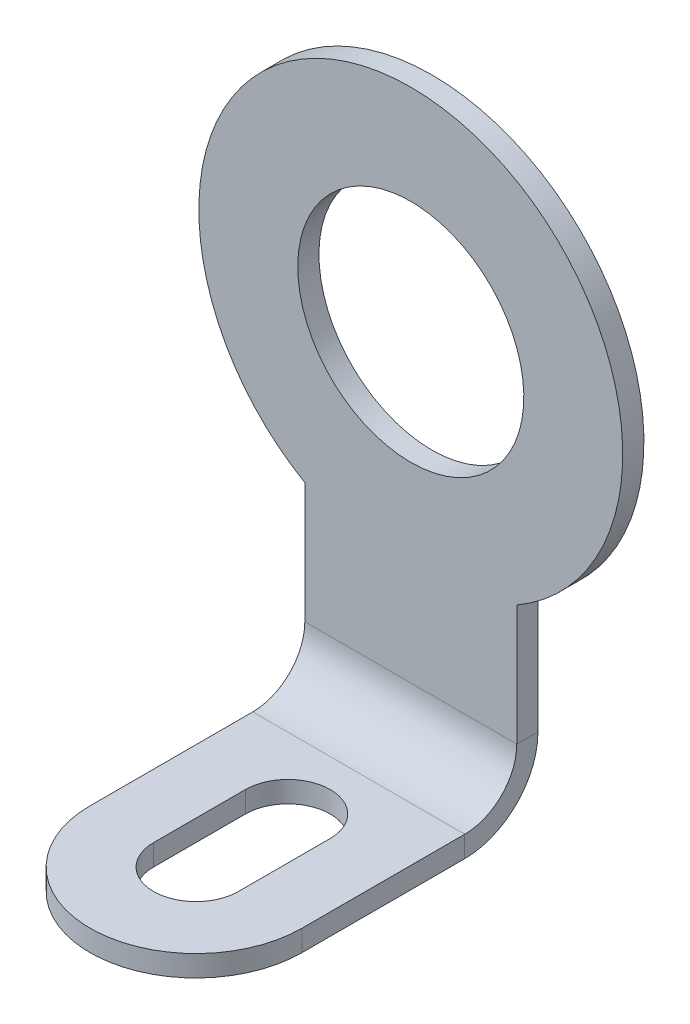
ISO-10303-21;
HEADER;
FILE_DESCRIPTION(('STEP AP214'),'2;1');
FILE_NAME('part.step','',(''),(''),'','','');
FILE_SCHEMA(('AUTOMOTIVE_DESIGN { 1 0 10303 214 1 1 1 1 }'));
ENDSEC;
DATA;
#1=APPLICATION_CONTEXT('core data for automotive mechanical design processes');
#2=APPLICATION_PROTOCOL_DEFINITION('international standard','automotive_design',2000,#1);
#3=PRODUCT_CONTEXT('',#1,'mechanical');
#4=PRODUCT('Part','Part','',(#3));
#5=PRODUCT_RELATED_PRODUCT_CATEGORY('part','',(#4));
#6=PRODUCT_DEFINITION_FORMATION('','',#4);
#7=PRODUCT_DEFINITION_CONTEXT('part definition',#1,'design');
#8=PRODUCT_DEFINITION('design','',#6,#7);
#9=PRODUCT_DEFINITION_SHAPE('','',#8);
#10=(LENGTH_UNIT() NAMED_UNIT(*) SI_UNIT(.MILLI.,.METRE.));
#11=(NAMED_UNIT(*) PLANE_ANGLE_UNIT() SI_UNIT($,.RADIAN.));
#12=(NAMED_UNIT(*) SI_UNIT($,.STERADIAN.) SOLID_ANGLE_UNIT());
#13=UNCERTAINTY_MEASURE_WITH_UNIT(LENGTH_MEASURE(1.E-05),#10,'distance_accuracy_value','');
#14=(GEOMETRIC_REPRESENTATION_CONTEXT(3) GLOBAL_UNCERTAINTY_ASSIGNED_CONTEXT((#13)) GLOBAL_UNIT_ASSIGNED_CONTEXT((#10,
#11,#12)) REPRESENTATION_CONTEXT('',''));
#15=CARTESIAN_POINT('',(0.,0.,0.));
#16=DIRECTION('',(0.,0.,1.));
#17=DIRECTION('',(1.,0.,0.));
#18=AXIS2_PLACEMENT_3D('',#15,#16,#17);
#19=CARTESIAN_POINT('',(0.,-2.95973401166818,4.65973401166817));
#20=DIRECTION('',(0.,0.,1.));
#21=DIRECTION('',(0.,-1.,0.));
#22=AXIS2_PLACEMENT_3D('',#19,#20,#21);
#23=PLANE('',#22);
#24=CARTESIAN_POINT('',(0.,5.04026598833182,4.65973401166819));
#25=DIRECTION('',(0.,0.,1.));
#26=DIRECTION('',(0.,-1.,0.));
#27=AXIS2_PLACEMENT_3D('',#24,#25,#26);
#28=CIRCLE('',#27,1.6);
#29=CARTESIAN_POINT('',(0.,3.44026598833182,4.65973401166819));
#30=VERTEX_POINT('',#29);
#31=EDGE_CURVE('E210',#30,#30,#28,.T.);
#32=ORIENTED_EDGE('',*,*,#31,.T.);
#33=EDGE_LOOP('',(#32));
#34=FACE_BOUND('',#33,.T.);
#35=DIRECTION('',(0.,1.,0.));
#36=VECTOR('',#35,1.);
#37=CARTESIAN_POINT('',(1.5,-2.95973401166818,4.65973401166817));
#38=LINE('',#37,#36);
#39=CARTESIAN_POINT('',(1.5,0.736600000000003,4.65973401166818));
#40=VERTEX_POINT('',#39);
#41=CARTESIAN_POINT('',(1.5,2.44218977697851,4.65973401166818));
#42=VERTEX_POINT('',#41);
#43=EDGE_CURVE('E45',#40,#42,#38,.T.);
#44=ORIENTED_EDGE('',*,*,#43,.F.);
#45=DIRECTION('',(-1.,0.,0.));
#46=VECTOR('',#45,1.);
#47=CARTESIAN_POINT('',(0.,0.736600000000003,4.65973401166818));
#48=LINE('',#47,#46);
#49=CARTESIAN_POINT('',(-1.5,0.736600000000004,4.65973401166818));
#50=VERTEX_POINT('',#49);
#51=EDGE_CURVE('E156',#40,#50,#48,.T.);
#52=ORIENTED_EDGE('',*,*,#51,.T.);
#53=DIRECTION('',(0.,-1.,0.));
#54=VECTOR('',#53,1.);
#55=CARTESIAN_POINT('',(-1.5,-2.95973401166818,4.65973401166817));
#56=LINE('',#55,#54);
#57=CARTESIAN_POINT('',(-1.5,2.44218977697851,4.65973401166818));
#58=VERTEX_POINT('',#57);
#59=EDGE_CURVE('E220',#58,#50,#56,.T.);
#60=ORIENTED_EDGE('',*,*,#59,.F.);
#61=CARTESIAN_POINT('',(0.,5.04026598833182,4.65973401166819));
#62=DIRECTION('',(0.,0.,1.));
#63=DIRECTION('',(0.,-1.,0.));
#64=AXIS2_PLACEMENT_3D('',#61,#62,#63);
#65=CIRCLE('',#64,3.);
#66=EDGE_CURVE('E217',#42,#58,#65,.T.);
#67=ORIENTED_EDGE('',*,*,#66,.F.);
#68=EDGE_LOOP('',(#44,#52,#60,#67));
#69=FACE_BOUND('',#68,.T.);
#70=ADVANCED_FACE('F41',(#34,#69),#23,.F.);
#71=CARTESIAN_POINT('',(-1.5,-2.95973401166818,4.65973401166817));
#72=DIRECTION('',(-1.,0.,0.));
#73=DIRECTION('',(0.,-1.,0.));
#74=AXIS2_PLACEMENT_3D('',#71,#72,#73);
#75=PLANE('',#74);
#76=DIRECTION('',(0.,0.,-1.));
#77=VECTOR('',#76,1.);
#78=CARTESIAN_POINT('',(-1.5,0.736600000000003,4.65973401166818));
#79=LINE('',#78,#77);
#80=CARTESIAN_POINT('',(-1.5,0.736600000000002,4.95973401166818));
#81=VERTEX_POINT('',#80);
#82=EDGE_CURVE('E12',#81,#50,#79,.T.);
#83=ORIENTED_EDGE('',*,*,#82,.F.);
#84=DIRECTION('',(0.,-1.,0.));
#85=VECTOR('',#84,1.);
#86=CARTESIAN_POINT('',(-1.5,-2.95973401166818,4.95973401166817));
#87=LINE('',#86,#85);
#88=CARTESIAN_POINT('',(-1.5,2.44218977697851,4.95973401166818));
#89=VERTEX_POINT('',#88);
#90=EDGE_CURVE('E58',#89,#81,#87,.T.);
#91=ORIENTED_EDGE('',*,*,#90,.F.);
#92=DIRECTION('',(0.,0.,1.));
#93=VECTOR('',#92,1.);
#94=CARTESIAN_POINT('',(-1.5,2.44218977697851,4.65973401166818));
#95=LINE('',#94,#93);
#96=EDGE_CURVE('E223',#58,#89,#95,.T.);
#97=ORIENTED_EDGE('',*,*,#96,.F.);
#98=ORIENTED_EDGE('',*,*,#59,.T.);
#99=EDGE_LOOP('',(#83,#91,#97,#98));
#100=FACE_BOUND('',#99,.T.);
#101=ADVANCED_FACE('F43',(#100),#75,.T.);
#102=CARTESIAN_POINT('',(0.,5.04026598833182,4.65973401166819));
#103=DIRECTION('',(0.,0.,1.));
#104=DIRECTION('',(0.,-1.,0.));
#105=AXIS2_PLACEMENT_3D('',#102,#103,#104);
#106=CYLINDRICAL_SURFACE('',#105,3.);
#107=CARTESIAN_POINT('',(0.,5.04026598833182,4.95973401166819));
#108=DIRECTION('',(0.,0.,1.));
#109=DIRECTION('',(0.,-1.,0.));
#110=AXIS2_PLACEMENT_3D('',#107,#108,#109);
#111=CIRCLE('',#110,3.);
#112=CARTESIAN_POINT('',(1.5,2.44218977697851,4.95973401166818));
#113=VERTEX_POINT('',#112);
#114=EDGE_CURVE('E221',#113,#89,#111,.T.);
#115=ORIENTED_EDGE('',*,*,#114,.F.);
#116=DIRECTION('',(0.,0.,1.));
#117=VECTOR('',#116,1.);
#118=CARTESIAN_POINT('',(1.5,2.44218977697851,4.65973401166818));
#119=LINE('',#118,#117);
#120=EDGE_CURVE('E225',#42,#113,#119,.T.);
#121=ORIENTED_EDGE('',*,*,#120,.F.);
#122=ORIENTED_EDGE('',*,*,#66,.T.);
#123=ORIENTED_EDGE('',*,*,#96,.T.);
#124=EDGE_LOOP('',(#115,#121,#122,#123));
#125=FACE_BOUND('',#124,.T.);
#126=ADVANCED_FACE('F240',(#125),#106,.T.);
#127=CARTESIAN_POINT('',(1.5,-2.95973401166818,4.65973401166817));
#128=DIRECTION('',(1.,0.,0.));
#129=DIRECTION('',(0.,1.,0.));
#130=AXIS2_PLACEMENT_3D('',#127,#128,#129);
#131=PLANE('',#130);
#132=DIRECTION('',(0.,0.,1.));
#133=VECTOR('',#132,1.);
#134=CARTESIAN_POINT('',(1.5,0.736600000000003,4.65973401166818));
#135=LINE('',#134,#133);
#136=CARTESIAN_POINT('',(1.5,0.736600000000002,4.95973401166818));
#137=VERTEX_POINT('',#136);
#138=EDGE_CURVE('E228',#40,#137,#135,.T.);
#139=ORIENTED_EDGE('',*,*,#138,.F.);
#140=ORIENTED_EDGE('',*,*,#43,.T.);
#141=ORIENTED_EDGE('',*,*,#120,.T.);
#142=DIRECTION('',(0.,1.,0.));
#143=VECTOR('',#142,1.);
#144=CARTESIAN_POINT('',(1.5,-2.95973401166818,4.95973401166817));
#145=LINE('',#144,#143);
#146=EDGE_CURVE('E66',#137,#113,#145,.T.);
#147=ORIENTED_EDGE('',*,*,#146,.F.);
#148=EDGE_LOOP('',(#139,#140,#141,#147));
#149=FACE_BOUND('',#148,.T.);
#150=ADVANCED_FACE('F237',(#149),#131,.T.);
#151=CARTESIAN_POINT('',(0.,-2.95973401166818,4.95973401166817));
#152=DIRECTION('',(0.,0.,1.));
#153=DIRECTION('',(0.,-1.,0.));
#154=AXIS2_PLACEMENT_3D('',#151,#152,#153);
#155=PLANE('',#154);
#156=DIRECTION('',(-1.,0.,0.));
#157=VECTOR('',#156,1.);
#158=CARTESIAN_POINT('',(0.,0.736600000000002,4.95973401166818));
#159=LINE('',#158,#157);
#160=EDGE_CURVE('E50',#137,#81,#159,.T.);
#161=ORIENTED_EDGE('',*,*,#160,.F.);
#162=ORIENTED_EDGE('',*,*,#146,.T.);
#163=ORIENTED_EDGE('',*,*,#114,.T.);
#164=ORIENTED_EDGE('',*,*,#90,.T.);
#165=EDGE_LOOP('',(#161,#162,#163,#164));
#166=FACE_BOUND('',#165,.T.);
#167=CARTESIAN_POINT('',(0.,5.04026598833182,4.95973401166819));
#168=DIRECTION('',(0.,0.,1.));
#169=DIRECTION('',(0.,-1.,0.));
#170=AXIS2_PLACEMENT_3D('',#167,#168,#169);
#171=CIRCLE('',#170,1.6);
#172=CARTESIAN_POINT('',(0.,3.44026598833182,4.95973401166819));
#173=VERTEX_POINT('',#172);
#174=EDGE_CURVE('E213',#173,#173,#171,.T.);
#175=ORIENTED_EDGE('',*,*,#174,.F.);
#176=EDGE_LOOP('',(#175));
#177=FACE_BOUND('',#176,.T.);
#178=ADVANCED_FACE('F233',(#166,#177),#155,.T.);
#179=CARTESIAN_POINT('',(0.,5.04026598833182,4.65973401166819));
#180=DIRECTION('',(0.,0.,1.));
#181=DIRECTION('',(0.,-1.,0.));
#182=AXIS2_PLACEMENT_3D('',#179,#180,#181);
#183=CYLINDRICAL_SURFACE('',#182,1.6);
#184=ORIENTED_EDGE('',*,*,#31,.F.);
#185=EDGE_LOOP('',(#184));
#186=FACE_BOUND('',#185,.T.);
#187=ORIENTED_EDGE('',*,*,#174,.T.);
#188=EDGE_LOOP('',(#187));
#189=FACE_BOUND('',#188,.T.);
#190=ADVANCED_FACE('F296',(#186,#189),#183,.F.);
#191=CARTESIAN_POINT('',(0.,-0.3,8.));
#192=DIRECTION('',(0.,1.,0.));
#193=DIRECTION('',(0.,0.,1.));
#194=AXIS2_PLACEMENT_3D('',#191,#192,#193);
#195=CYLINDRICAL_SURFACE('',#194,0.6);
#196=CARTESIAN_POINT('',(0.,0.,8.));
#197=DIRECTION('',(0.,1.,0.));
#198=DIRECTION('',(0.,0.,1.));
#199=AXIS2_PLACEMENT_3D('',#196,#197,#198);
#200=CIRCLE('',#199,0.6);
#201=CARTESIAN_POINT('',(-0.6,0.,8.));
#202=VERTEX_POINT('',#201);
#203=CARTESIAN_POINT('',(0.6,0.,8.));
#204=VERTEX_POINT('',#203);
#205=EDGE_CURVE('E169',#202,#204,#200,.T.);
#206=ORIENTED_EDGE('',*,*,#205,.T.);
#207=DIRECTION('',(0.,1.,0.));
#208=VECTOR('',#207,1.);
#209=CARTESIAN_POINT('',(0.6,-0.3,8.));
#210=LINE('',#209,#208);
#211=CARTESIAN_POINT('',(0.6,-0.3,8.));
#212=VERTEX_POINT('',#211);
#213=EDGE_CURVE('E191',#212,#204,#210,.T.);
#214=ORIENTED_EDGE('',*,*,#213,.F.);
#215=CARTESIAN_POINT('',(0.,-0.3,8.));
#216=DIRECTION('',(0.,1.,0.));
#217=DIRECTION('',(0.,0.,1.));
#218=AXIS2_PLACEMENT_3D('',#215,#216,#217);
#219=CIRCLE('',#218,0.6);
#220=CARTESIAN_POINT('',(-0.6,-0.3,8.));
#221=VERTEX_POINT('',#220);
#222=EDGE_CURVE('E173',#221,#212,#219,.T.);
#223=ORIENTED_EDGE('',*,*,#222,.F.);
#224=DIRECTION('',(0.,1.,0.));
#225=VECTOR('',#224,1.);
#226=CARTESIAN_POINT('',(-0.6,-0.3,8.));
#227=LINE('',#226,#225);
#228=EDGE_CURVE('E206',#221,#202,#227,.T.);
#229=ORIENTED_EDGE('',*,*,#228,.T.);
#230=EDGE_LOOP('',(#206,#214,#223,#229));
#231=FACE_BOUND('',#230,.T.);
#232=ADVANCED_FACE('F300',(#231),#195,.F.);
#233=CARTESIAN_POINT('',(-0.6,-0.3,6.7));
#234=DIRECTION('',(-1.,0.,0.));
#235=DIRECTION('',(0.,0.,1.));
#236=AXIS2_PLACEMENT_3D('',#233,#234,#235);
#237=PLANE('',#236);
#238=DIRECTION('',(0.,0.,1.));
#239=VECTOR('',#238,1.);
#240=CARTESIAN_POINT('',(-0.6,0.,6.7));
#241=LINE('',#240,#239);
#242=CARTESIAN_POINT('',(-0.6,0.,6.7));
#243=VERTEX_POINT('',#242);
#244=EDGE_CURVE('E203',#243,#202,#241,.T.);
#245=ORIENTED_EDGE('',*,*,#244,.T.);
#246=ORIENTED_EDGE('',*,*,#228,.F.);
#247=DIRECTION('',(0.,0.,1.));
#248=VECTOR('',#247,1.);
#249=CARTESIAN_POINT('',(-0.6,-0.3,6.7));
#250=LINE('',#249,#248);
#251=CARTESIAN_POINT('',(-0.6,-0.3,6.7));
#252=VERTEX_POINT('',#251);
#253=EDGE_CURVE('E176',#252,#221,#250,.T.);
#254=ORIENTED_EDGE('',*,*,#253,.F.);
#255=DIRECTION('',(0.,1.,0.));
#256=VECTOR('',#255,1.);
#257=CARTESIAN_POINT('',(-0.6,-0.3,6.7));
#258=LINE('',#257,#256);
#259=EDGE_CURVE('E200',#252,#243,#258,.T.);
#260=ORIENTED_EDGE('',*,*,#259,.T.);
#261=EDGE_LOOP('',(#245,#246,#254,#260));
#262=FACE_BOUND('',#261,.T.);
#263=ADVANCED_FACE('F305',(#262),#237,.F.);
#264=CARTESIAN_POINT('',(0.,-0.3,6.7));
#265=DIRECTION('',(0.,1.,0.));
#266=DIRECTION('',(0.,0.,1.));
#267=AXIS2_PLACEMENT_3D('',#264,#265,#266);
#268=CYLINDRICAL_SURFACE('',#267,0.6);
#269=CARTESIAN_POINT('',(0.,0.,6.7));
#270=DIRECTION('',(0.,1.,0.));
#271=DIRECTION('',(0.,0.,1.));
#272=AXIS2_PLACEMENT_3D('',#269,#270,#271);
#273=CIRCLE('',#272,0.6);
#274=CARTESIAN_POINT('',(0.6,0.,6.7));
#275=VERTEX_POINT('',#274);
#276=EDGE_CURVE('E198',#275,#243,#273,.T.);
#277=ORIENTED_EDGE('',*,*,#276,.T.);
#278=ORIENTED_EDGE('',*,*,#259,.F.);
#279=CARTESIAN_POINT('',(0.,-0.3,6.7));
#280=DIRECTION('',(0.,1.,0.));
#281=DIRECTION('',(0.,0.,1.));
#282=AXIS2_PLACEMENT_3D('',#279,#280,#281);
#283=CIRCLE('',#282,0.6);
#284=CARTESIAN_POINT('',(0.6,-0.3,6.7));
#285=VERTEX_POINT('',#284);
#286=EDGE_CURVE('E182',#285,#252,#283,.T.);
#287=ORIENTED_EDGE('',*,*,#286,.F.);
#288=DIRECTION('',(0.,1.,0.));
#289=VECTOR('',#288,1.);
#290=CARTESIAN_POINT('',(0.6,-0.3,6.7));
#291=LINE('',#290,#289);
#292=EDGE_CURVE('E196',#285,#275,#291,.T.);
#293=ORIENTED_EDGE('',*,*,#292,.T.);
#294=EDGE_LOOP('',(#277,#278,#287,#293));
#295=FACE_BOUND('',#294,.T.);
#296=ADVANCED_FACE('F314',(#295),#268,.F.);
#297=CARTESIAN_POINT('',(0.6,-0.3,6.7));
#298=DIRECTION('',(1.,0.,0.));
#299=DIRECTION('',(0.,0.,-1.));
#300=AXIS2_PLACEMENT_3D('',#297,#298,#299);
#301=PLANE('',#300);
#302=DIRECTION('',(0.,0.,-1.));
#303=VECTOR('',#302,1.);
#304=CARTESIAN_POINT('',(0.6,0.,6.7));
#305=LINE('',#304,#303);
#306=EDGE_CURVE('E193',#204,#275,#305,.T.);
#307=ORIENTED_EDGE('',*,*,#306,.T.);
#308=ORIENTED_EDGE('',*,*,#292,.F.);
#309=DIRECTION('',(0.,0.,-1.));
#310=VECTOR('',#309,1.);
#311=CARTESIAN_POINT('',(0.6,-0.3,6.7));
#312=LINE('',#311,#310);
#313=EDGE_CURVE('E185',#212,#285,#312,.T.);
#314=ORIENTED_EDGE('',*,*,#313,.F.);
#315=ORIENTED_EDGE('',*,*,#213,.T.);
#316=EDGE_LOOP('',(#307,#308,#314,#315));
#317=FACE_BOUND('',#316,.T.);
#318=ADVANCED_FACE('F321',(#317),#301,.F.);
#319=CARTESIAN_POINT('',(0.,-0.3,8.));
#320=DIRECTION('',(0.,1.,0.));
#321=DIRECTION('',(0.,0.,1.));
#322=AXIS2_PLACEMENT_3D('',#319,#320,#321);
#323=CYLINDRICAL_SURFACE('',#322,1.5);
#324=CARTESIAN_POINT('',(0.,0.,8.));
#325=DIRECTION('',(0.,1.,0.));
#326=DIRECTION('',(0.,0.,1.));
#327=AXIS2_PLACEMENT_3D('',#324,#325,#326);
#328=CIRCLE('',#327,1.5);
#329=CARTESIAN_POINT('',(-1.5,0.,8.));
#330=VERTEX_POINT('',#329);
#331=CARTESIAN_POINT('',(1.5,0.,8.));
#332=VERTEX_POINT('',#331);
#333=EDGE_CURVE('E262',#330,#332,#328,.T.);
#334=ORIENTED_EDGE('',*,*,#333,.F.);
#335=DIRECTION('',(0.,1.,0.));
#336=VECTOR('',#335,1.);
#337=CARTESIAN_POINT('',(-1.5,-0.3,8.));
#338=LINE('',#337,#336);
#339=CARTESIAN_POINT('',(-1.5,-0.3,8.));
#340=VERTEX_POINT('',#339);
#341=EDGE_CURVE('E216',#340,#330,#338,.T.);
#342=ORIENTED_EDGE('',*,*,#341,.F.);
#343=CARTESIAN_POINT('',(0.,-0.3,8.));
#344=DIRECTION('',(0.,1.,0.));
#345=DIRECTION('',(0.,0.,1.));
#346=AXIS2_PLACEMENT_3D('',#343,#344,#345);
#347=CIRCLE('',#346,1.5);
#348=CARTESIAN_POINT('',(1.5,-0.3,8.));
#349=VERTEX_POINT('',#348);
#350=EDGE_CURVE('E189',#340,#349,#347,.T.);
#351=ORIENTED_EDGE('',*,*,#350,.T.);
#352=DIRECTION('',(0.,1.,0.));
#353=VECTOR('',#352,1.);
#354=CARTESIAN_POINT('',(1.5,-0.3,8.));
#355=LINE('',#354,#353);
#356=EDGE_CURVE('E172',#349,#332,#355,.T.);
#357=ORIENTED_EDGE('',*,*,#356,.T.);
#358=EDGE_LOOP('',(#334,#342,#351,#357));
#359=FACE_BOUND('',#358,.T.);
#360=ADVANCED_FACE('F272',(#359),#323,.T.);
#361=CARTESIAN_POINT('',(0.,-0.3,8.));
#362=DIRECTION('',(0.,1.,0.));
#363=DIRECTION('',(0.,0.,1.));
#364=AXIS2_PLACEMENT_3D('',#361,#362,#363);
#365=PLANE('',#364);
#366=DIRECTION('',(-1.,0.,0.));
#367=VECTOR('',#366,1.);
#368=CARTESIAN_POINT('',(0.,-0.3,5.69633401166818));
#369=LINE('',#368,#367);
#370=CARTESIAN_POINT('',(1.5,-0.3,5.69633401166818));
#371=VERTEX_POINT('',#370);
#372=CARTESIAN_POINT('',(-1.5,-0.3,5.69633401166818));
#373=VERTEX_POINT('',#372);
#374=EDGE_CURVE('E153',#371,#373,#369,.T.);
#375=ORIENTED_EDGE('',*,*,#374,.F.);
#376=DIRECTION('',(0.,0.,-1.));
#377=VECTOR('',#376,1.);
#378=CARTESIAN_POINT('',(1.5,-0.3,8.));
#379=LINE('',#378,#377);
#380=EDGE_CURVE('E147',#349,#371,#379,.T.);
#381=ORIENTED_EDGE('',*,*,#380,.F.);
#382=ORIENTED_EDGE('',*,*,#350,.F.);
#383=DIRECTION('',(0.,0.,1.));
#384=VECTOR('',#383,1.);
#385=CARTESIAN_POINT('',(-1.5,-0.3,8.));
#386=LINE('',#385,#384);
#387=EDGE_CURVE('E167',#373,#340,#386,.T.);
#388=ORIENTED_EDGE('',*,*,#387,.F.);
#389=EDGE_LOOP('',(#375,#381,#382,#388));
#390=FACE_BOUND('',#389,.T.);
#391=ORIENTED_EDGE('',*,*,#313,.T.);
#392=ORIENTED_EDGE('',*,*,#286,.T.);
#393=ORIENTED_EDGE('',*,*,#253,.T.);
#394=ORIENTED_EDGE('',*,*,#222,.T.);
#395=EDGE_LOOP('',(#391,#392,#393,#394));
#396=FACE_BOUND('',#395,.T.);
#397=ADVANCED_FACE('F163',(#390,#396),#365,.F.);
#398=CARTESIAN_POINT('',(1.5,-0.3,8.));
#399=DIRECTION('',(1.,0.,0.));
#400=DIRECTION('',(0.,0.,-1.));
#401=AXIS2_PLACEMENT_3D('',#398,#399,#400);
#402=PLANE('',#401);
#403=ORIENTED_EDGE('',*,*,#380,.T.);
#404=DIRECTION('',(0.,1.,0.));
#405=VECTOR('',#404,1.);
#406=CARTESIAN_POINT('',(1.5,-0.3,5.69633401166818));
#407=LINE('',#406,#405);
#408=CARTESIAN_POINT('',(1.5,0.,5.69633401166818));
#409=VERTEX_POINT('',#408);
#410=EDGE_CURVE('E134',#371,#409,#407,.T.);
#411=ORIENTED_EDGE('',*,*,#410,.T.);
#412=DIRECTION('',(0.,0.,-1.));
#413=VECTOR('',#412,1.);
#414=CARTESIAN_POINT('',(1.5,0.,8.));
#415=LINE('',#414,#413);
#416=EDGE_CURVE('E146',#332,#409,#415,.T.);
#417=ORIENTED_EDGE('',*,*,#416,.F.);
#418=ORIENTED_EDGE('',*,*,#356,.F.);
#419=EDGE_LOOP('',(#403,#411,#417,#418));
#420=FACE_BOUND('',#419,.T.);
#421=ADVANCED_FACE('F171',(#420),#402,.T.);
#422=CARTESIAN_POINT('',(0.,0.,8.));
#423=DIRECTION('',(0.,1.,0.));
#424=DIRECTION('',(0.,0.,1.));
#425=AXIS2_PLACEMENT_3D('',#422,#423,#424);
#426=PLANE('',#425);
#427=ORIENTED_EDGE('',*,*,#276,.F.);
#428=ORIENTED_EDGE('',*,*,#306,.F.);
#429=ORIENTED_EDGE('',*,*,#205,.F.);
#430=ORIENTED_EDGE('',*,*,#244,.F.);
#431=EDGE_LOOP('',(#427,#428,#429,#430));
#432=FACE_BOUND('',#431,.T.);
#433=ORIENTED_EDGE('',*,*,#416,.T.);
#434=DIRECTION('',(-1.,0.,0.));
#435=VECTOR('',#434,1.);
#436=CARTESIAN_POINT('',(0.,0.,5.69633401166818));
#437=LINE('',#436,#435);
#438=CARTESIAN_POINT('',(-1.5,0.,5.69633401166818));
#439=VERTEX_POINT('',#438);
#440=EDGE_CURVE('E253',#409,#439,#437,.T.);
#441=ORIENTED_EDGE('',*,*,#440,.T.);
#442=DIRECTION('',(0.,0.,1.));
#443=VECTOR('',#442,1.);
#444=CARTESIAN_POINT('',(-1.5,0.,8.));
#445=LINE('',#444,#443);
#446=EDGE_CURVE('E265',#439,#330,#445,.T.);
#447=ORIENTED_EDGE('',*,*,#446,.T.);
#448=ORIENTED_EDGE('',*,*,#333,.T.);
#449=EDGE_LOOP('',(#433,#441,#447,#448));
#450=FACE_BOUND('',#449,.T.);
#451=ADVANCED_FACE('F268',(#432,#450),#426,.T.);
#452=CARTESIAN_POINT('',(-1.5,-0.3,8.));
#453=DIRECTION('',(-1.,0.,0.));
#454=DIRECTION('',(0.,0.,1.));
#455=AXIS2_PLACEMENT_3D('',#452,#453,#454);
#456=PLANE('',#455);
#457=ORIENTED_EDGE('',*,*,#446,.F.);
#458=DIRECTION('',(0.,-1.,0.));
#459=VECTOR('',#458,1.);
#460=CARTESIAN_POINT('',(-1.5,-0.3,5.69633401166818));
#461=LINE('',#460,#459);
#462=EDGE_CURVE('E247',#439,#373,#461,.T.);
#463=ORIENTED_EDGE('',*,*,#462,.T.);
#464=ORIENTED_EDGE('',*,*,#387,.T.);
#465=ORIENTED_EDGE('',*,*,#341,.T.);
#466=EDGE_LOOP('',(#457,#463,#464,#465));
#467=FACE_BOUND('',#466,.T.);
#468=ADVANCED_FACE('F274',(#467),#456,.T.);
#469=CARTESIAN_POINT('',(1.5,0.7366,5.69633401166818));
#470=DIRECTION('',(1.,0.,0.));
#471=DIRECTION('',(0.,0.,-1.));
#472=AXIS2_PLACEMENT_3D('',#469,#470,#471);
#473=PLANE('',#472);
#474=ORIENTED_EDGE('',*,*,#138,.T.);
#475=CARTESIAN_POINT('',(1.5,0.7366,5.69633401166818));
#476=DIRECTION('',(1.,0.,0.));
#477=DIRECTION('',(0.,0.,-1.));
#478=AXIS2_PLACEMENT_3D('',#475,#476,#477);
#479=CIRCLE('',#478,0.7366);
#480=EDGE_CURVE('E141',#137,#409,#479,.F.);
#481=ORIENTED_EDGE('',*,*,#480,.T.);
#482=ORIENTED_EDGE('',*,*,#410,.F.);
#483=CARTESIAN_POINT('',(1.5,0.7366,5.69633401166818));
#484=DIRECTION('',(-1.,0.,0.));
#485=DIRECTION('',(0.,0.,-1.));
#486=AXIS2_PLACEMENT_3D('',#483,#484,#485);
#487=CIRCLE('',#486,1.0366);
#488=EDGE_CURVE('E138',#40,#371,#487,.T.);
#489=ORIENTED_EDGE('',*,*,#488,.F.);
#490=EDGE_LOOP('',(#474,#481,#482,#489));
#491=FACE_BOUND('',#490,.T.);
#492=ADVANCED_FACE('F137',(#491),#473,.T.);
#493=CARTESIAN_POINT('',(-1.5,0.7366,5.69633401166818));
#494=DIRECTION('',(-1.,0.,0.));
#495=DIRECTION('',(0.,0.,1.));
#496=AXIS2_PLACEMENT_3D('',#493,#494,#495);
#497=PLANE('',#496);
#498=ORIENTED_EDGE('',*,*,#462,.F.);
#499=CARTESIAN_POINT('',(-1.5,0.7366,5.69633401166818));
#500=DIRECTION('',(1.,0.,0.));
#501=DIRECTION('',(0.,0.,-1.));
#502=AXIS2_PLACEMENT_3D('',#499,#500,#501);
#503=CIRCLE('',#502,0.7366);
#504=EDGE_CURVE('E158',#439,#81,#503,.T.);
#505=ORIENTED_EDGE('',*,*,#504,.T.);
#506=ORIENTED_EDGE('',*,*,#82,.T.);
#507=CARTESIAN_POINT('',(-1.5,0.7366,5.69633401166818));
#508=DIRECTION('',(1.,0.,0.));
#509=DIRECTION('',(0.,0.,1.));
#510=AXIS2_PLACEMENT_3D('',#507,#508,#509);
#511=CIRCLE('',#510,1.0366);
#512=EDGE_CURVE('E157',#373,#50,#511,.T.);
#513=ORIENTED_EDGE('',*,*,#512,.F.);
#514=EDGE_LOOP('',(#498,#505,#506,#513));
#515=FACE_BOUND('',#514,.T.);
#516=ADVANCED_FACE('F246',(#515),#497,.T.);
#517=CARTESIAN_POINT('',(-3.32107275187154,0.7366,5.69633401166818));
#518=DIRECTION('',(1.,0.,0.));
#519=DIRECTION('',(0.,0.,-1.));
#520=AXIS2_PLACEMENT_3D('',#517,#518,#519);
#521=CYLINDRICAL_SURFACE('',#520,1.0366);
#522=ORIENTED_EDGE('',*,*,#512,.T.);
#523=ORIENTED_EDGE('',*,*,#51,.F.);
#524=ORIENTED_EDGE('',*,*,#488,.T.);
#525=ORIENTED_EDGE('',*,*,#374,.T.);
#526=EDGE_LOOP('',(#522,#523,#524,#525));
#527=FACE_BOUND('',#526,.T.);
#528=ADVANCED_FACE('F152',(#527),#521,.T.);
#529=CARTESIAN_POINT('',(-3.32107275187154,0.7366,5.69633401166818));
#530=DIRECTION('',(1.,0.,0.));
#531=DIRECTION('',(0.,0.,-1.));
#532=AXIS2_PLACEMENT_3D('',#529,#530,#531);
#533=CYLINDRICAL_SURFACE('',#532,0.7366);
#534=ORIENTED_EDGE('',*,*,#504,.F.);
#535=ORIENTED_EDGE('',*,*,#440,.F.);
#536=ORIENTED_EDGE('',*,*,#480,.F.);
#537=ORIENTED_EDGE('',*,*,#160,.T.);
#538=EDGE_LOOP('',(#534,#535,#536,#537));
#539=FACE_BOUND('',#538,.T.);
#540=ADVANCED_FACE('F251',(#539),#533,.F.);
#541=CLOSED_SHELL('',(#70,#101,#126,#150,#178,#190,#232,#263,#296,#318,#360,#397,#421,#451,#468,
#492,#516,#528,#540));
#542=MANIFOLD_SOLID_BREP('B2',#541);
#543=ADVANCED_BREP_SHAPE_REPRESENTATION('',(#18,#542),#14);
#544=SHAPE_DEFINITION_REPRESENTATION(#9,#543);
ENDSEC;
END-ISO-10303-21;
